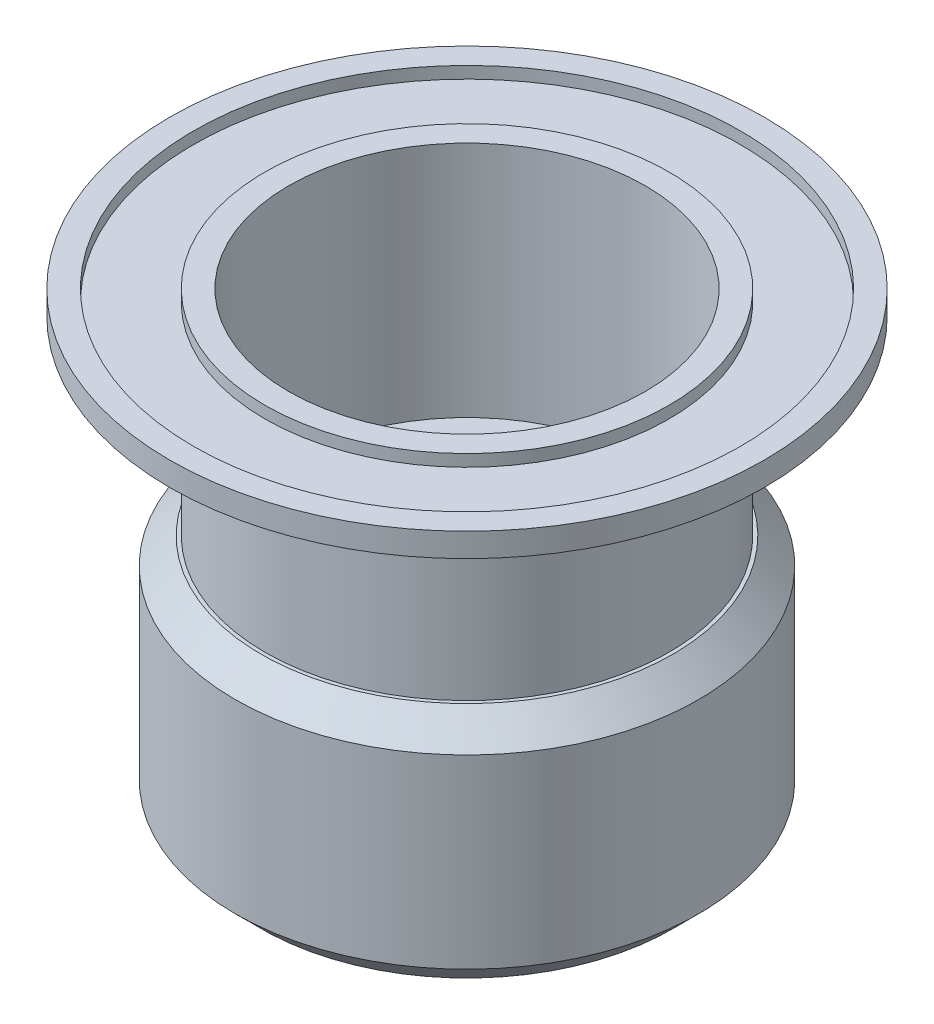
ISO-10303-21;
HEADER;
FILE_DESCRIPTION(('STEP AP214'),'2;1');
FILE_NAME('part.step','',(''),(''),'','','');
FILE_SCHEMA(('AUTOMOTIVE_DESIGN { 1 0 10303 214 1 1 1 1 }'));
ENDSEC;
DATA;
#1=APPLICATION_CONTEXT('core data for automotive mechanical design processes');
#2=APPLICATION_PROTOCOL_DEFINITION('international standard','automotive_design',2000,#1);
#3=PRODUCT_CONTEXT('',#1,'mechanical');
#4=PRODUCT('Part','Part','',(#3));
#5=PRODUCT_RELATED_PRODUCT_CATEGORY('part','',(#4));
#6=PRODUCT_DEFINITION_FORMATION('','',#4);
#7=PRODUCT_DEFINITION_CONTEXT('part definition',#1,'design');
#8=PRODUCT_DEFINITION('design','',#6,#7);
#9=PRODUCT_DEFINITION_SHAPE('','',#8);
#10=(LENGTH_UNIT() NAMED_UNIT(*) SI_UNIT(.MILLI.,.METRE.));
#11=(NAMED_UNIT(*) PLANE_ANGLE_UNIT() SI_UNIT($,.RADIAN.));
#12=(NAMED_UNIT(*) SI_UNIT($,.STERADIAN.) SOLID_ANGLE_UNIT());
#13=UNCERTAINTY_MEASURE_WITH_UNIT(LENGTH_MEASURE(1.E-05),#10,'distance_accuracy_value','');
#14=(GEOMETRIC_REPRESENTATION_CONTEXT(3) GLOBAL_UNCERTAINTY_ASSIGNED_CONTEXT((#13)) GLOBAL_UNIT_ASSIGNED_CONTEXT((#10,
#11,#12)) REPRESENTATION_CONTEXT('',''));
#15=CARTESIAN_POINT('',(0.,0.,0.));
#16=DIRECTION('',(0.,0.,1.));
#17=DIRECTION('',(1.,0.,0.));
#18=AXIS2_PLACEMENT_3D('',#15,#16,#17);
#19=CARTESIAN_POINT('',(0.,0.,0.));
#20=DIRECTION('',(0.,1.,0.));
#21=DIRECTION('',(0.,0.,1.));
#22=AXIS2_PLACEMENT_3D('',#19,#20,#21);
#23=CYLINDRICAL_SURFACE('',#22,17.);
#24=CARTESIAN_POINT('',(0.,-2.,0.));
#25=DIRECTION('',(0.,1.,0.));
#26=DIRECTION('',(0.,0.,1.));
#27=AXIS2_PLACEMENT_3D('',#24,#25,#26);
#28=CIRCLE('',#27,17.);
#29=CARTESIAN_POINT('',(0.,-2.,17.));
#30=VERTEX_POINT('',#29);
#31=EDGE_CURVE('E136',#30,#30,#28,.T.);
#32=ORIENTED_EDGE('',*,*,#31,.F.);
#33=EDGE_LOOP('',(#32));
#34=FACE_BOUND('',#33,.T.);
#35=CARTESIAN_POINT('',(0.,-18.,0.));
#36=DIRECTION('',(0.,-1.,0.));
#37=DIRECTION('',(0.,0.,-1.));
#38=AXIS2_PLACEMENT_3D('',#35,#36,#37);
#39=CIRCLE('',#38,17.);
#40=CARTESIAN_POINT('',(0.,-18.,-17.));
#41=VERTEX_POINT('',#40);
#42=EDGE_CURVE('E148',#41,#41,#39,.T.);
#43=ORIENTED_EDGE('',*,*,#42,.F.);
#44=EDGE_LOOP('',(#43));
#45=FACE_BOUND('',#44,.T.);
#46=ADVANCED_FACE('F38',(#34,#45),#23,.T.);
#47=CARTESIAN_POINT('',(15.,0.,0.));
#48=DIRECTION('',(0.,-1.,0.));
#49=DIRECTION('',(0.,0.,-1.));
#50=AXIS2_PLACEMENT_3D('',#47,#48,#49);
#51=PLANE('',#50);
#52=CARTESIAN_POINT('',(0.,0.,0.));
#53=DIRECTION('',(0.,1.,0.));
#54=DIRECTION('',(0.,0.,1.));
#55=AXIS2_PLACEMENT_3D('',#52,#53,#54);
#56=CIRCLE('',#55,23.);
#57=CARTESIAN_POINT('',(0.,0.,23.));
#58=VERTEX_POINT('',#57);
#59=EDGE_CURVE('E122',#58,#58,#56,.T.);
#60=ORIENTED_EDGE('',*,*,#59,.F.);
#61=EDGE_LOOP('',(#60));
#62=FACE_BOUND('',#61,.T.);
#63=CARTESIAN_POINT('',(0.,0.,0.));
#64=DIRECTION('',(0.,1.,0.));
#65=DIRECTION('',(0.,0.,1.));
#66=AXIS2_PLACEMENT_3D('',#63,#64,#65);
#67=CIRCLE('',#66,25.);
#68=CARTESIAN_POINT('',(0.,0.,25.));
#69=VERTEX_POINT('',#68);
#70=EDGE_CURVE('E142',#69,#69,#67,.T.);
#71=ORIENTED_EDGE('',*,*,#70,.T.);
#72=EDGE_LOOP('',(#71));
#73=FACE_BOUND('',#72,.T.);
#74=ADVANCED_FACE('F241',(#62,#73),#51,.F.);
#75=CARTESIAN_POINT('',(0.,0.,0.));
#76=DIRECTION('',(0.,1.,0.));
#77=DIRECTION('',(0.,0.,1.));
#78=AXIS2_PLACEMENT_3D('',#75,#76,#77);
#79=CYLINDRICAL_SURFACE('',#78,25.);
#80=ORIENTED_EDGE('',*,*,#70,.F.);
#81=EDGE_LOOP('',(#80));
#82=FACE_BOUND('',#81,.T.);
#83=CARTESIAN_POINT('',(0.,-2.,0.));
#84=DIRECTION('',(0.,1.,0.));
#85=DIRECTION('',(0.,0.,1.));
#86=AXIS2_PLACEMENT_3D('',#83,#84,#85);
#87=CIRCLE('',#86,25.);
#88=CARTESIAN_POINT('',(0.,-2.,25.));
#89=VERTEX_POINT('',#88);
#90=EDGE_CURVE('E139',#89,#89,#87,.T.);
#91=ORIENTED_EDGE('',*,*,#90,.T.);
#92=EDGE_LOOP('',(#91));
#93=FACE_BOUND('',#92,.T.);
#94=ADVANCED_FACE('F263',(#82,#93),#79,.T.);
#95=CARTESIAN_POINT('',(17.,-2.,0.));
#96=DIRECTION('',(0.,1.,0.));
#97=DIRECTION('',(0.,0.,1.));
#98=AXIS2_PLACEMENT_3D('',#95,#96,#97);
#99=PLANE('',#98);
#100=ORIENTED_EDGE('',*,*,#90,.F.);
#101=EDGE_LOOP('',(#100));
#102=FACE_BOUND('',#101,.T.);
#103=ORIENTED_EDGE('',*,*,#31,.T.);
#104=EDGE_LOOP('',(#103));
#105=FACE_BOUND('',#104,.T.);
#106=ADVANCED_FACE('F268',(#102,#105),#99,.F.);
#107=CARTESIAN_POINT('',(0.,-1.,0.));
#108=DIRECTION('',(0.,1.,0.));
#109=DIRECTION('',(0.,0.,1.));
#110=AXIS2_PLACEMENT_3D('',#107,#108,#109);
#111=CYLINDRICAL_SURFACE('',#110,23.);
#112=CARTESIAN_POINT('',(0.,-1.,0.));
#113=DIRECTION('',(0.,1.,0.));
#114=DIRECTION('',(0.,0.,1.));
#115=AXIS2_PLACEMENT_3D('',#112,#113,#114);
#116=CIRCLE('',#115,23.);
#117=CARTESIAN_POINT('',(0.,-1.,23.));
#118=VERTEX_POINT('',#117);
#119=EDGE_CURVE('E125',#118,#118,#116,.T.);
#120=ORIENTED_EDGE('',*,*,#119,.F.);
#121=EDGE_LOOP('',(#120));
#122=FACE_BOUND('',#121,.T.);
#123=ORIENTED_EDGE('',*,*,#59,.T.);
#124=EDGE_LOOP('',(#123));
#125=FACE_BOUND('',#124,.T.);
#126=ADVANCED_FACE('F251',(#122,#125),#111,.F.);
#127=CARTESIAN_POINT('',(0.,-1.,0.));
#128=DIRECTION('',(0.,1.,0.));
#129=DIRECTION('',(0.,0.,1.));
#130=AXIS2_PLACEMENT_3D('',#127,#128,#129);
#131=PLANE('',#130);
#132=CARTESIAN_POINT('',(0.,-1.,0.));
#133=DIRECTION('',(0.,1.,0.));
#134=DIRECTION('',(0.,0.,1.));
#135=AXIS2_PLACEMENT_3D('',#132,#133,#134);
#136=CIRCLE('',#135,17.);
#137=CARTESIAN_POINT('',(0.,-1.,17.));
#138=VERTEX_POINT('',#137);
#139=EDGE_CURVE('E119',#138,#138,#136,.T.);
#140=ORIENTED_EDGE('',*,*,#139,.F.);
#141=EDGE_LOOP('',(#140));
#142=FACE_BOUND('',#141,.T.);
#143=ORIENTED_EDGE('',*,*,#119,.T.);
#144=EDGE_LOOP('',(#143));
#145=FACE_BOUND('',#144,.T.);
#146=ADVANCED_FACE('F245',(#142,#145),#131,.T.);
#147=CARTESIAN_POINT('',(0.,-1.,0.));
#148=DIRECTION('',(0.,1.,0.));
#149=DIRECTION('',(0.,0.,1.));
#150=AXIS2_PLACEMENT_3D('',#147,#148,#149);
#151=CYLINDRICAL_SURFACE('',#150,17.);
#152=ORIENTED_EDGE('',*,*,#139,.T.);
#153=EDGE_LOOP('',(#152));
#154=FACE_BOUND('',#153,.T.);
#155=CARTESIAN_POINT('',(0.,0.,0.));
#156=DIRECTION('',(0.,1.,0.));
#157=DIRECTION('',(0.,0.,1.));
#158=AXIS2_PLACEMENT_3D('',#155,#156,#157);
#159=CIRCLE('',#158,17.);
#160=CARTESIAN_POINT('',(0.,0.,17.));
#161=VERTEX_POINT('',#160);
#162=EDGE_CURVE('E116',#161,#161,#159,.T.);
#163=ORIENTED_EDGE('',*,*,#162,.F.);
#164=EDGE_LOOP('',(#163));
#165=FACE_BOUND('',#164,.T.);
#166=ADVANCED_FACE('F225',(#154,#165),#151,.T.);
#167=CARTESIAN_POINT('',(15.,-20.,0.));
#168=DIRECTION('',(0.,-1.,0.));
#169=DIRECTION('',(0.,0.,-1.));
#170=AXIS2_PLACEMENT_3D('',#167,#168,#169);
#171=PLANE('',#170);
#172=CARTESIAN_POINT('',(-10.,-20.,0.));
#173=DIRECTION('',(0.,1.,0.));
#174=DIRECTION('',(0.,0.,1.));
#175=AXIS2_PLACEMENT_3D('',#172,#173,#174);
#176=CIRCLE('',#175,4.);
#177=CARTESIAN_POINT('',(-10.,-20.,4.));
#178=VERTEX_POINT('',#177);
#179=EDGE_CURVE('E207',#178,#178,#176,.T.);
#180=ORIENTED_EDGE('',*,*,#179,.F.);
#181=EDGE_LOOP('',(#180));
#182=FACE_BOUND('',#181,.T.);
#183=CARTESIAN_POINT('',(0.,-20.,10.));
#184=DIRECTION('',(0.,1.,0.));
#185=DIRECTION('',(0.,0.,1.));
#186=AXIS2_PLACEMENT_3D('',#183,#184,#185);
#187=CIRCLE('',#186,4.);
#188=CARTESIAN_POINT('',(0.,-20.,14.));
#189=VERTEX_POINT('',#188);
#190=EDGE_CURVE('E210',#189,#189,#187,.T.);
#191=ORIENTED_EDGE('',*,*,#190,.F.);
#192=EDGE_LOOP('',(#191));
#193=FACE_BOUND('',#192,.T.);
#194=CARTESIAN_POINT('',(10.,-20.,0.));
#195=DIRECTION('',(0.,1.,0.));
#196=DIRECTION('',(0.,0.,1.));
#197=AXIS2_PLACEMENT_3D('',#194,#195,#196);
#198=CIRCLE('',#197,4.);
#199=CARTESIAN_POINT('',(10.,-20.,4.00000000000001));
#200=VERTEX_POINT('',#199);
#201=EDGE_CURVE('E213',#200,#200,#198,.T.);
#202=ORIENTED_EDGE('',*,*,#201,.F.);
#203=EDGE_LOOP('',(#202));
#204=FACE_BOUND('',#203,.T.);
#205=CARTESIAN_POINT('',(0.,-20.,-10.));
#206=DIRECTION('',(0.,1.,0.));
#207=DIRECTION('',(0.,0.,1.));
#208=AXIS2_PLACEMENT_3D('',#205,#206,#207);
#209=CIRCLE('',#208,4.);
#210=CARTESIAN_POINT('',(0.,-20.,-6.));
#211=VERTEX_POINT('',#210);
#212=EDGE_CURVE('E110',#211,#211,#209,.T.);
#213=ORIENTED_EDGE('',*,*,#212,.F.);
#214=EDGE_LOOP('',(#213));
#215=FACE_BOUND('',#214,.T.);
#216=DIRECTION('',(-1.,0.,0.));
#217=VECTOR('',#216,1.);
#218=CARTESIAN_POINT('',(-5.,-20.,-5.));
#219=LINE('',#218,#217);
#220=CARTESIAN_POINT('',(5.,-20.,-5.));
#221=VERTEX_POINT('',#220);
#222=CARTESIAN_POINT('',(-5.,-20.,-5.));
#223=VERTEX_POINT('',#222);
#224=EDGE_CURVE('E88',#221,#223,#219,.T.);
#225=ORIENTED_EDGE('',*,*,#224,.F.);
#226=DIRECTION('',(0.,0.,-1.));
#227=VECTOR('',#226,1.);
#228=CARTESIAN_POINT('',(5.,-20.,5.));
#229=LINE('',#228,#227);
#230=CARTESIAN_POINT('',(5.,-20.,5.));
#231=VERTEX_POINT('',#230);
#232=EDGE_CURVE('E53',#231,#221,#229,.T.);
#233=ORIENTED_EDGE('',*,*,#232,.F.);
#234=DIRECTION('',(1.,0.,0.));
#235=VECTOR('',#234,1.);
#236=CARTESIAN_POINT('',(-5.,-20.,5.));
#237=LINE('',#236,#235);
#238=CARTESIAN_POINT('',(-5.,-20.,5.));
#239=VERTEX_POINT('',#238);
#240=EDGE_CURVE('E104',#239,#231,#237,.T.);
#241=ORIENTED_EDGE('',*,*,#240,.F.);
#242=DIRECTION('',(0.,0.,1.));
#243=VECTOR('',#242,1.);
#244=CARTESIAN_POINT('',(-5.,-20.,5.));
#245=LINE('',#244,#243);
#246=EDGE_CURVE('E112',#223,#239,#245,.T.);
#247=ORIENTED_EDGE('',*,*,#246,.F.);
#248=EDGE_LOOP('',(#225,#233,#241,#247));
#249=FACE_BOUND('',#248,.T.);
#250=CARTESIAN_POINT('',(0.,-20.,0.));
#251=DIRECTION('',(0.,1.,0.));
#252=DIRECTION('',(0.,0.,1.));
#253=AXIS2_PLACEMENT_3D('',#250,#251,#252);
#254=CIRCLE('',#253,15.);
#255=CARTESIAN_POINT('',(0.,-20.,15.));
#256=VERTEX_POINT('',#255);
#257=EDGE_CURVE('E133',#256,#256,#254,.T.);
#258=ORIENTED_EDGE('',*,*,#257,.T.);
#259=EDGE_LOOP('',(#258));
#260=FACE_BOUND('',#259,.T.);
#261=ADVANCED_FACE('F221',(#182,#193,#204,#215,#249,#260),#171,.F.);
#262=CARTESIAN_POINT('',(0.,0.,0.));
#263=DIRECTION('',(0.,1.,0.));
#264=DIRECTION('',(0.,0.,1.));
#265=AXIS2_PLACEMENT_3D('',#262,#263,#264);
#266=CYLINDRICAL_SURFACE('',#265,15.);
#267=ORIENTED_EDGE('',*,*,#257,.F.);
#268=EDGE_LOOP('',(#267));
#269=FACE_BOUND('',#268,.T.);
#270=CARTESIAN_POINT('',(0.,0.,0.));
#271=DIRECTION('',(0.,1.,0.));
#272=DIRECTION('',(0.,0.,1.));
#273=AXIS2_PLACEMENT_3D('',#270,#271,#272);
#274=CIRCLE('',#273,15.);
#275=CARTESIAN_POINT('',(0.,0.,15.));
#276=VERTEX_POINT('',#275);
#277=EDGE_CURVE('E128',#276,#276,#274,.T.);
#278=ORIENTED_EDGE('',*,*,#277,.T.);
#279=EDGE_LOOP('',(#278));
#280=FACE_BOUND('',#279,.T.);
#281=ADVANCED_FACE('F224',(#269,#280),#266,.F.);
#282=ORIENTED_EDGE('',*,*,#277,.F.);
#283=EDGE_LOOP('',(#282));
#284=FACE_BOUND('',#283,.T.);
#285=ORIENTED_EDGE('',*,*,#162,.T.);
#286=EDGE_LOOP('',(#285));
#287=FACE_BOUND('',#286,.T.);
#288=ADVANCED_FACE('F233',(#284,#287),#51,.F.);
#289=CARTESIAN_POINT('',(5.,-21.5,5.));
#290=DIRECTION('',(1.,0.,0.));
#291=DIRECTION('',(0.,0.,-1.));
#292=AXIS2_PLACEMENT_3D('',#289,#290,#291);
#293=PLANE('',#292);
#294=ORIENTED_EDGE('',*,*,#232,.T.);
#295=DIRECTION('',(0.,1.,0.));
#296=VECTOR('',#295,1.);
#297=CARTESIAN_POINT('',(5.,-21.5,-5.));
#298=LINE('',#297,#296);
#299=CARTESIAN_POINT('',(5.,-21.5,-5.));
#300=VERTEX_POINT('',#299);
#301=EDGE_CURVE('E76',#300,#221,#298,.T.);
#302=ORIENTED_EDGE('',*,*,#301,.F.);
#303=DIRECTION('',(0.,0.,-1.));
#304=VECTOR('',#303,1.);
#305=CARTESIAN_POINT('',(5.,-21.5,5.));
#306=LINE('',#305,#304);
#307=CARTESIAN_POINT('',(5.,-21.5,5.));
#308=VERTEX_POINT('',#307);
#309=EDGE_CURVE('E102',#308,#300,#306,.T.);
#310=ORIENTED_EDGE('',*,*,#309,.F.);
#311=DIRECTION('',(0.,1.,0.));
#312=VECTOR('',#311,1.);
#313=CARTESIAN_POINT('',(5.,-21.5,5.));
#314=LINE('',#313,#312);
#315=EDGE_CURVE('E61',#308,#231,#314,.T.);
#316=ORIENTED_EDGE('',*,*,#315,.T.);
#317=EDGE_LOOP('',(#294,#302,#310,#316));
#318=FACE_BOUND('',#317,.T.);
#319=ADVANCED_FACE('F239',(#318),#293,.F.);
#320=CARTESIAN_POINT('',(-5.,-21.5,5.));
#321=DIRECTION('',(0.,0.,1.));
#322=DIRECTION('',(1.,0.,0.));
#323=AXIS2_PLACEMENT_3D('',#320,#321,#322);
#324=PLANE('',#323);
#325=ORIENTED_EDGE('',*,*,#240,.T.);
#326=ORIENTED_EDGE('',*,*,#315,.F.);
#327=DIRECTION('',(1.,0.,0.));
#328=VECTOR('',#327,1.);
#329=CARTESIAN_POINT('',(-5.,-21.5,5.));
#330=LINE('',#329,#328);
#331=CARTESIAN_POINT('',(-5.,-21.5,5.));
#332=VERTEX_POINT('',#331);
#333=EDGE_CURVE('E99',#332,#308,#330,.T.);
#334=ORIENTED_EDGE('',*,*,#333,.F.);
#335=DIRECTION('',(0.,1.,0.));
#336=VECTOR('',#335,1.);
#337=CARTESIAN_POINT('',(-5.,-21.5,5.));
#338=LINE('',#337,#336);
#339=EDGE_CURVE('E92',#332,#239,#338,.T.);
#340=ORIENTED_EDGE('',*,*,#339,.T.);
#341=EDGE_LOOP('',(#325,#326,#334,#340));
#342=FACE_BOUND('',#341,.T.);
#343=ADVANCED_FACE('F309',(#342),#324,.F.);
#344=CARTESIAN_POINT('',(-5.,-21.5,5.));
#345=DIRECTION('',(-1.,0.,0.));
#346=DIRECTION('',(0.,0.,1.));
#347=AXIS2_PLACEMENT_3D('',#344,#345,#346);
#348=PLANE('',#347);
#349=ORIENTED_EDGE('',*,*,#246,.T.);
#350=ORIENTED_EDGE('',*,*,#339,.F.);
#351=DIRECTION('',(0.,0.,1.));
#352=VECTOR('',#351,1.);
#353=CARTESIAN_POINT('',(-5.,-21.5,5.));
#354=LINE('',#353,#352);
#355=CARTESIAN_POINT('',(-5.,-21.5,-5.));
#356=VERTEX_POINT('',#355);
#357=EDGE_CURVE('E95',#356,#332,#354,.T.);
#358=ORIENTED_EDGE('',*,*,#357,.F.);
#359=DIRECTION('',(0.,1.,0.));
#360=VECTOR('',#359,1.);
#361=CARTESIAN_POINT('',(-5.,-21.5,-5.));
#362=LINE('',#361,#360);
#363=EDGE_CURVE('E81',#356,#223,#362,.T.);
#364=ORIENTED_EDGE('',*,*,#363,.T.);
#365=EDGE_LOOP('',(#349,#350,#358,#364));
#366=FACE_BOUND('',#365,.T.);
#367=ADVANCED_FACE('F96',(#366),#348,.F.);
#368=CARTESIAN_POINT('',(-5.,-21.5,-5.));
#369=DIRECTION('',(0.,0.,-1.));
#370=DIRECTION('',(-1.,0.,0.));
#371=AXIS2_PLACEMENT_3D('',#368,#369,#370);
#372=PLANE('',#371);
#373=ORIENTED_EDGE('',*,*,#224,.T.);
#374=ORIENTED_EDGE('',*,*,#363,.F.);
#375=DIRECTION('',(-1.,0.,0.));
#376=VECTOR('',#375,1.);
#377=CARTESIAN_POINT('',(-5.,-21.5,-5.));
#378=LINE('',#377,#376);
#379=EDGE_CURVE('E85',#300,#356,#378,.T.);
#380=ORIENTED_EDGE('',*,*,#379,.F.);
#381=ORIENTED_EDGE('',*,*,#301,.T.);
#382=EDGE_LOOP('',(#373,#374,#380,#381));
#383=FACE_BOUND('',#382,.T.);
#384=ADVANCED_FACE('F83',(#383),#372,.F.);
#385=CARTESIAN_POINT('',(0.,-21.5,0.));
#386=DIRECTION('',(0.,-1.,0.));
#387=DIRECTION('',(0.,0.,-1.));
#388=AXIS2_PLACEMENT_3D('',#385,#386,#387);
#389=PLANE('',#388);
#390=CARTESIAN_POINT('',(0.,-21.5,0.));
#391=DIRECTION('',(0.,1.,0.));
#392=DIRECTION('',(0.,0.,1.));
#393=AXIS2_PLACEMENT_3D('',#390,#391,#392);
#394=CIRCLE('',#393,2.75);
#395=CARTESIAN_POINT('',(0.,-21.5,2.75));
#396=VERTEX_POINT('',#395);
#397=EDGE_CURVE('E153',#396,#396,#394,.T.);
#398=ORIENTED_EDGE('',*,*,#397,.F.);
#399=EDGE_LOOP('',(#398));
#400=FACE_BOUND('',#399,.T.);
#401=ORIENTED_EDGE('',*,*,#309,.T.);
#402=ORIENTED_EDGE('',*,*,#379,.T.);
#403=ORIENTED_EDGE('',*,*,#357,.T.);
#404=ORIENTED_EDGE('',*,*,#333,.T.);
#405=EDGE_LOOP('',(#401,#402,#403,#404));
#406=FACE_BOUND('',#405,.T.);
#407=ADVANCED_FACE('F101',(#400,#406),#389,.F.);
#408=CARTESIAN_POINT('',(0.,-22.,-10.));
#409=DIRECTION('',(0.,1.,0.));
#410=DIRECTION('',(0.,0.,1.));
#411=AXIS2_PLACEMENT_3D('',#408,#409,#410);
#412=CYLINDRICAL_SURFACE('',#411,4.);
#413=ORIENTED_EDGE('',*,*,#212,.T.);
#414=EDGE_LOOP('',(#413));
#415=FACE_BOUND('',#414,.T.);
#416=CARTESIAN_POINT('',(0.,-23.,-10.));
#417=DIRECTION('',(0.,-1.,0.));
#418=DIRECTION('',(0.,0.,-1.));
#419=AXIS2_PLACEMENT_3D('',#416,#417,#418);
#420=CIRCLE('',#419,4.);
#421=CARTESIAN_POINT('',(0.,-23.,-14.));
#422=VERTEX_POINT('',#421);
#423=EDGE_CURVE('E195',#422,#422,#420,.T.);
#424=ORIENTED_EDGE('',*,*,#423,.T.);
#425=EDGE_LOOP('',(#424));
#426=FACE_BOUND('',#425,.T.);
#427=ADVANCED_FACE('F218',(#415,#426),#412,.F.);
#428=CARTESIAN_POINT('',(10.,-22.,0.));
#429=DIRECTION('',(0.,1.,0.));
#430=DIRECTION('',(0.,0.,1.));
#431=AXIS2_PLACEMENT_3D('',#428,#429,#430);
#432=CYLINDRICAL_SURFACE('',#431,4.);
#433=ORIENTED_EDGE('',*,*,#201,.T.);
#434=EDGE_LOOP('',(#433));
#435=FACE_BOUND('',#434,.T.);
#436=CARTESIAN_POINT('',(10.,-23.,0.));
#437=DIRECTION('',(0.,-1.,0.));
#438=DIRECTION('',(0.,0.,-1.));
#439=AXIS2_PLACEMENT_3D('',#436,#437,#438);
#440=CIRCLE('',#439,4.);
#441=CARTESIAN_POINT('',(10.,-23.,-4.));
#442=VERTEX_POINT('',#441);
#443=EDGE_CURVE('E192',#442,#442,#440,.T.);
#444=ORIENTED_EDGE('',*,*,#443,.T.);
#445=EDGE_LOOP('',(#444));
#446=FACE_BOUND('',#445,.T.);
#447=ADVANCED_FACE('F341',(#435,#446),#432,.F.);
#448=CARTESIAN_POINT('',(0.,-22.,10.));
#449=DIRECTION('',(0.,1.,0.));
#450=DIRECTION('',(0.,0.,1.));
#451=AXIS2_PLACEMENT_3D('',#448,#449,#450);
#452=CYLINDRICAL_SURFACE('',#451,4.);
#453=ORIENTED_EDGE('',*,*,#190,.T.);
#454=EDGE_LOOP('',(#453));
#455=FACE_BOUND('',#454,.T.);
#456=CARTESIAN_POINT('',(0.,-23.,10.));
#457=DIRECTION('',(0.,-1.,0.));
#458=DIRECTION('',(0.,0.,-1.));
#459=AXIS2_PLACEMENT_3D('',#456,#457,#458);
#460=CIRCLE('',#459,4.);
#461=CARTESIAN_POINT('',(0.,-23.,6.));
#462=VERTEX_POINT('',#461);
#463=EDGE_CURVE('E204',#462,#462,#460,.T.);
#464=ORIENTED_EDGE('',*,*,#463,.T.);
#465=EDGE_LOOP('',(#464));
#466=FACE_BOUND('',#465,.T.);
#467=ADVANCED_FACE('F351',(#455,#466),#452,.F.);
#468=CARTESIAN_POINT('',(-10.,-22.,0.));
#469=DIRECTION('',(0.,1.,0.));
#470=DIRECTION('',(0.,0.,1.));
#471=AXIS2_PLACEMENT_3D('',#468,#469,#470);
#472=CYLINDRICAL_SURFACE('',#471,4.);
#473=ORIENTED_EDGE('',*,*,#179,.T.);
#474=EDGE_LOOP('',(#473));
#475=FACE_BOUND('',#474,.T.);
#476=CARTESIAN_POINT('',(-10.,-23.,0.));
#477=DIRECTION('',(0.,-1.,0.));
#478=DIRECTION('',(0.,0.,-1.));
#479=AXIS2_PLACEMENT_3D('',#476,#477,#478);
#480=CIRCLE('',#479,4.);
#481=CARTESIAN_POINT('',(-10.,-23.,-4.));
#482=VERTEX_POINT('',#481);
#483=EDGE_CURVE('E201',#482,#482,#480,.T.);
#484=ORIENTED_EDGE('',*,*,#483,.T.);
#485=EDGE_LOOP('',(#484));
#486=FACE_BOUND('',#485,.T.);
#487=ADVANCED_FACE('F360',(#475,#486),#472,.F.);
#488=CARTESIAN_POINT('',(0.,-23.,0.));
#489=DIRECTION('',(0.,-1.,0.));
#490=DIRECTION('',(0.,0.,-1.));
#491=AXIS2_PLACEMENT_3D('',#488,#489,#490);
#492=PLANE('',#491);
#493=CARTESIAN_POINT('',(0.,-23.,0.));
#494=DIRECTION('',(0.,-1.,0.));
#495=DIRECTION('',(0.,0.,-1.));
#496=AXIS2_PLACEMENT_3D('',#493,#494,#495);
#497=CIRCLE('',#496,2.75);
#498=CARTESIAN_POINT('',(0.,-23.,-2.75));
#499=VERTEX_POINT('',#498);
#500=EDGE_CURVE('E149',#499,#499,#497,.T.);
#501=ORIENTED_EDGE('',*,*,#500,.F.);
#502=EDGE_LOOP('',(#501));
#503=FACE_BOUND('',#502,.T.);
#504=CARTESIAN_POINT('',(0.,-23.,0.));
#505=DIRECTION('',(0.,-1.,0.));
#506=DIRECTION('',(0.,0.,-1.));
#507=AXIS2_PLACEMENT_3D('',#504,#505,#506);
#508=CIRCLE('',#507,15.);
#509=CARTESIAN_POINT('',(0.,-23.,-15.));
#510=VERTEX_POINT('',#509);
#511=EDGE_CURVE('E145',#510,#510,#508,.F.);
#512=ORIENTED_EDGE('',*,*,#511,.F.);
#513=EDGE_LOOP('',(#512));
#514=FACE_BOUND('',#513,.T.);
#515=ORIENTED_EDGE('',*,*,#423,.F.);
#516=EDGE_LOOP('',(#515));
#517=FACE_BOUND('',#516,.T.);
#518=ORIENTED_EDGE('',*,*,#463,.F.);
#519=EDGE_LOOP('',(#518));
#520=FACE_BOUND('',#519,.T.);
#521=ORIENTED_EDGE('',*,*,#483,.F.);
#522=EDGE_LOOP('',(#521));
#523=FACE_BOUND('',#522,.T.);
#524=ORIENTED_EDGE('',*,*,#443,.F.);
#525=EDGE_LOOP('',(#524));
#526=FACE_BOUND('',#525,.T.);
#527=ADVANCED_FACE('F187',(#503,#514,#517,#520,#523,#526),#492,.T.);
#528=CARTESIAN_POINT('',(0.,-38.,0.));
#529=DIRECTION('',(0.,-1.,0.));
#530=DIRECTION('',(0.,0.,-1.));
#531=AXIS2_PLACEMENT_3D('',#528,#529,#530);
#532=PLANE('',#531);
#533=CARTESIAN_POINT('',(0.,-38.,0.));
#534=DIRECTION('',(0.,-1.,0.));
#535=DIRECTION('',(0.,0.,-1.));
#536=AXIS2_PLACEMENT_3D('',#533,#534,#535);
#537=CIRCLE('',#536,17.305);
#538=CARTESIAN_POINT('',(0.,-38.,-17.305));
#539=VERTEX_POINT('',#538);
#540=EDGE_CURVE('E11',#539,#539,#537,.T.);
#541=ORIENTED_EDGE('',*,*,#540,.T.);
#542=EDGE_LOOP('',(#541));
#543=FACE_BOUND('',#542,.T.);
#544=CARTESIAN_POINT('',(0.,-38.,0.));
#545=DIRECTION('',(0.,-1.,0.));
#546=DIRECTION('',(0.,0.,-1.));
#547=AXIS2_PLACEMENT_3D('',#544,#545,#546);
#548=CIRCLE('',#547,15.);
#549=CARTESIAN_POINT('',(0.,-38.,-15.));
#550=VERTEX_POINT('',#549);
#551=EDGE_CURVE('E152',#550,#550,#548,.T.);
#552=ORIENTED_EDGE('',*,*,#551,.F.);
#553=EDGE_LOOP('',(#552));
#554=FACE_BOUND('',#553,.T.);
#555=ADVANCED_FACE('F183',(#543,#554),#532,.T.);
#556=CARTESIAN_POINT('',(0.,-38.,0.));
#557=DIRECTION('',(0.,1.,0.));
#558=DIRECTION('',(0.,0.,1.));
#559=AXIS2_PLACEMENT_3D('',#556,#557,#558);
#560=CYLINDRICAL_SURFACE('',#559,15.);
#561=ORIENTED_EDGE('',*,*,#551,.T.);
#562=EDGE_LOOP('',(#561));
#563=FACE_BOUND('',#562,.T.);
#564=ORIENTED_EDGE('',*,*,#511,.T.);
#565=EDGE_LOOP('',(#564));
#566=FACE_BOUND('',#565,.T.);
#567=ADVANCED_FACE('F186',(#563,#566),#560,.F.);
#568=CARTESIAN_POINT('',(0.,-38.,0.));
#569=DIRECTION('',(0.,1.,0.));
#570=DIRECTION('',(0.,0.,1.));
#571=AXIS2_PLACEMENT_3D('',#568,#569,#570);
#572=CYLINDRICAL_SURFACE('',#571,2.75);
#573=ORIENTED_EDGE('',*,*,#500,.T.);
#574=EDGE_LOOP('',(#573));
#575=FACE_BOUND('',#574,.T.);
#576=ORIENTED_EDGE('',*,*,#397,.T.);
#577=EDGE_LOOP('',(#576));
#578=FACE_BOUND('',#577,.T.);
#579=ADVANCED_FACE('F175',(#575,#578),#572,.F.);
#580=CARTESIAN_POINT('',(0.,-18.,0.));
#581=DIRECTION('',(0.,-1.,0.));
#582=DIRECTION('',(0.,0.,-1.));
#583=AXIS2_PLACEMENT_3D('',#580,#581,#582);
#584=CYLINDRICAL_SURFACE('',#583,19.5);
#585=CARTESIAN_POINT('',(0.,-20.195,0.));
#586=DIRECTION('',(0.,-1.,0.));
#587=DIRECTION('',(0.,0.,-1.));
#588=AXIS2_PLACEMENT_3D('',#585,#586,#587);
#589=CIRCLE('',#588,19.5);
#590=CARTESIAN_POINT('',(0.,-20.195,-19.5));
#591=VERTEX_POINT('',#590);
#592=EDGE_CURVE('E159',#591,#591,#589,.T.);
#593=ORIENTED_EDGE('',*,*,#592,.T.);
#594=EDGE_LOOP('',(#593));
#595=FACE_BOUND('',#594,.T.);
#596=CARTESIAN_POINT('',(0.,-35.805,0.));
#597=DIRECTION('',(0.,-1.,0.));
#598=DIRECTION('',(0.,0.,-1.));
#599=AXIS2_PLACEMENT_3D('',#596,#597,#598);
#600=CIRCLE('',#599,19.5);
#601=CARTESIAN_POINT('',(0.,-35.805,-19.5));
#602=VERTEX_POINT('',#601);
#603=EDGE_CURVE('E156',#602,#602,#600,.F.);
#604=ORIENTED_EDGE('',*,*,#603,.T.);
#605=EDGE_LOOP('',(#604));
#606=FACE_BOUND('',#605,.T.);
#607=ADVANCED_FACE('F172',(#595,#606),#584,.T.);
#608=CARTESIAN_POINT('',(0.,-18.,0.));
#609=DIRECTION('',(0.,-1.,0.));
#610=DIRECTION('',(0.,0.,-1.));
#611=AXIS2_PLACEMENT_3D('',#608,#609,#610);
#612=PLANE('',#611);
#613=CARTESIAN_POINT('',(0.,-18.,0.));
#614=DIRECTION('',(0.,-1.,0.));
#615=DIRECTION('',(0.,0.,-1.));
#616=AXIS2_PLACEMENT_3D('',#613,#614,#615);
#617=CIRCLE('',#616,17.305);
#618=CARTESIAN_POINT('',(0.,-18.,-17.305));
#619=VERTEX_POINT('',#618);
#620=EDGE_CURVE('E46',#619,#619,#617,.F.);
#621=ORIENTED_EDGE('',*,*,#620,.T.);
#622=EDGE_LOOP('',(#621));
#623=FACE_BOUND('',#622,.T.);
#624=ORIENTED_EDGE('',*,*,#42,.T.);
#625=EDGE_LOOP('',(#624));
#626=FACE_BOUND('',#625,.T.);
#627=ADVANCED_FACE('F164',(#623,#626),#612,.F.);
#628=CARTESIAN_POINT('',(0.,-20.195,0.));
#629=DIRECTION('',(0.,-1.,0.));
#630=DIRECTION('',(0.,0.,-1.));
#631=AXIS2_PLACEMENT_3D('',#628,#629,#630);
#632=CONICAL_SURFACE('',#631,19.5,0.78539816339745);
#633=ORIENTED_EDGE('',*,*,#620,.F.);
#634=EDGE_LOOP('',(#633));
#635=FACE_BOUND('',#634,.T.);
#636=ORIENTED_EDGE('',*,*,#592,.F.);
#637=EDGE_LOOP('',(#636));
#638=FACE_BOUND('',#637,.T.);
#639=ADVANCED_FACE('F167',(#635,#638),#632,.T.);
#640=CARTESIAN_POINT('',(0.,-38.,0.));
#641=DIRECTION('',(0.,1.,0.));
#642=DIRECTION('',(0.,0.,1.));
#643=AXIS2_PLACEMENT_3D('',#640,#641,#642);
#644=CONICAL_SURFACE('',#643,17.305,0.785398163397446);
#645=ORIENTED_EDGE('',*,*,#603,.F.);
#646=EDGE_LOOP('',(#645));
#647=FACE_BOUND('',#646,.T.);
#648=ORIENTED_EDGE('',*,*,#540,.F.);
#649=EDGE_LOOP('',(#648));
#650=FACE_BOUND('',#649,.T.);
#651=ADVANCED_FACE('F40',(#647,#650),#644,.T.);
#652=CLOSED_SHELL('',(#46,#74,#94,#106,#126,#146,#166,#261,#281,#288,#319,#343,#367,#384,#407,
#427,#447,#467,#487,#527,#555,#567,#579,#607,#627,#639,#651));
#653=MANIFOLD_SOLID_BREP('B2',#652);
#654=ADVANCED_BREP_SHAPE_REPRESENTATION('',(#18,#653),#14);
#655=SHAPE_DEFINITION_REPRESENTATION(#9,#654);
ENDSEC;
END-ISO-10303-21;
